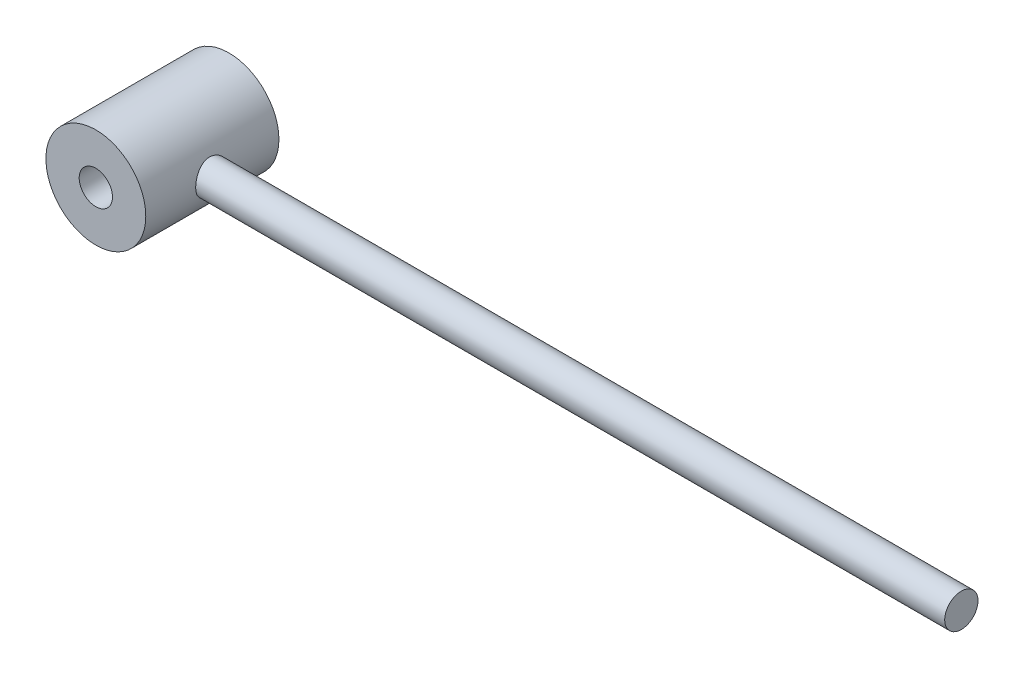
ISO-10303-21;
HEADER;
FILE_DESCRIPTION(('STEP AP214'),'2;1');
FILE_NAME('part.step','',(''),(''),'','','');
FILE_SCHEMA(('AUTOMOTIVE_DESIGN { 1 0 10303 214 1 1 1 1 }'));
ENDSEC;
DATA;
#1=APPLICATION_CONTEXT('core data for automotive mechanical design processes');
#2=APPLICATION_PROTOCOL_DEFINITION('international standard','automotive_design',2000,#1);
#3=PRODUCT_CONTEXT('',#1,'mechanical');
#4=PRODUCT('Part','Part','',(#3));
#5=PRODUCT_RELATED_PRODUCT_CATEGORY('part','',(#4));
#6=PRODUCT_DEFINITION_FORMATION('','',#4);
#7=PRODUCT_DEFINITION_CONTEXT('part definition',#1,'design');
#8=PRODUCT_DEFINITION('design','',#6,#7);
#9=PRODUCT_DEFINITION_SHAPE('','',#8);
#10=(LENGTH_UNIT() NAMED_UNIT(*) SI_UNIT(.MILLI.,.METRE.));
#11=(NAMED_UNIT(*) PLANE_ANGLE_UNIT() SI_UNIT($,.RADIAN.));
#12=(NAMED_UNIT(*) SI_UNIT($,.STERADIAN.) SOLID_ANGLE_UNIT());
#13=UNCERTAINTY_MEASURE_WITH_UNIT(LENGTH_MEASURE(1.E-05),#10,'distance_accuracy_value','');
#14=(GEOMETRIC_REPRESENTATION_CONTEXT(3) GLOBAL_UNCERTAINTY_ASSIGNED_CONTEXT((#13)) GLOBAL_UNIT_ASSIGNED_CONTEXT((#10,
#11,#12)) REPRESENTATION_CONTEXT('',''));
#15=CARTESIAN_POINT('',(0.,0.,0.));
#16=DIRECTION('',(0.,0.,1.));
#17=DIRECTION('',(1.,0.,0.));
#18=AXIS2_PLACEMENT_3D('',#15,#16,#17);
#19=CARTESIAN_POINT('',(0.,0.,-25.4));
#20=DIRECTION('',(0.,0.,1.));
#21=DIRECTION('',(1.,0.,0.));
#22=AXIS2_PLACEMENT_3D('',#19,#20,#21);
#23=CYLINDRICAL_SURFACE('',#22,19.05);
#24=CARTESIAN_POINT('',(0.,0.,-25.4));
#25=DIRECTION('',(0.,0.,1.));
#26=DIRECTION('',(1.,0.,0.));
#27=AXIS2_PLACEMENT_3D('',#24,#25,#26);
#28=CIRCLE('',#27,19.05);
#29=CARTESIAN_POINT('',(19.05,0.,-25.4));
#30=VERTEX_POINT('',#29);
#31=EDGE_CURVE('E45',#30,#30,#28,.T.);
#32=ORIENTED_EDGE('',*,*,#31,.T.);
#33=EDGE_LOOP('',(#32));
#34=FACE_BOUND('',#33,.T.);
#35=CARTESIAN_POINT('',(0.,0.,25.4));
#36=DIRECTION('',(0.,0.,1.));
#37=DIRECTION('',(1.,0.,0.));
#38=AXIS2_PLACEMENT_3D('',#35,#36,#37);
#39=CIRCLE('',#38,19.05);
#40=CARTESIAN_POINT('',(19.05,0.,25.4));
#41=VERTEX_POINT('',#40);
#42=EDGE_CURVE('E49',#41,#41,#39,.T.);
#43=ORIENTED_EDGE('',*,*,#42,.F.);
#44=EDGE_LOOP('',(#43));
#45=FACE_BOUND('',#44,.T.);
#46=CARTESIAN_POINT('',(19.0500000000001,0.,6.35));
#47=CARTESIAN_POINT('',(19.0500000475545,-0.173206979816119,6.35000007236222));
#48=CARTESIAN_POINT('',(19.0476323411038,-0.346412900541872,6.3429075600704));
#49=CARTESIAN_POINT('',(19.0382249618458,-0.691601311110428,6.31460114031544));
#50=CARTESIAN_POINT('',(19.0311835975216,-0.863583335207503,6.29338212009784));
#51=CARTESIAN_POINT('',(19.0126222999959,-1.20495064928588,6.23702757623515));
#52=CARTESIAN_POINT('',(19.0011036986832,-1.37433669595719,6.20189619118303));
#53=CARTESIAN_POINT('',(18.9738932742665,-1.70942803420246,6.11802244062094));
#54=CARTESIAN_POINT('',(18.9581998392036,-1.87513187719383,6.06927481733638));
#55=CARTESIAN_POINT('',(18.9230954347253,-2.20132105058003,5.95871469261192));
#56=CARTESIAN_POINT('',(18.9036923038523,-2.36181656426822,5.89692971091266));
#57=CARTESIAN_POINT('',(18.861643657703,-2.67697294486434,5.76071157228421));
#58=CARTESIAN_POINT('',(18.8389969432077,-2.83163162693659,5.68627373542708));
#59=CARTESIAN_POINT('',(18.7910497757426,-3.1340689975051,5.52534595404424));
#60=CARTESIAN_POINT('',(18.7657498753001,-3.28184910924856,5.43885851762675));
#61=CARTESIAN_POINT('',(18.7131195970424,-3.56974509074052,5.25439435152895));
#62=CARTESIAN_POINT('',(18.6857884919782,-3.7098581839242,5.15641349943325));
#63=CARTESIAN_POINT('',(18.6289146881802,-3.98578637726498,4.94641198872552));
#64=CARTESIAN_POINT('',(18.5993296703084,-4.12133296305892,4.83404987098847));
#65=CARTESIAN_POINT('',(18.5395154443744,-4.38255929576645,4.59854343363201));
#66=CARTESIAN_POINT('',(18.5092862220122,-4.50823882336201,4.47539887447669));
#67=CARTESIAN_POINT('',(18.4489772883087,-4.74901553774604,4.21903852526588));
#68=CARTESIAN_POINT('',(18.4188976388164,-4.86410864366073,4.08581888720946));
#69=CARTESIAN_POINT('',(18.3597250300466,-5.08289666356065,3.810198173399));
#70=CARTESIAN_POINT('',(18.3306317360784,-5.18659547118077,3.66780026058159));
#71=CARTESIAN_POINT('',(18.2734042587362,-5.38480736636175,3.37034355668632));
#72=CARTESIAN_POINT('',(18.2453229440573,-5.47896348886475,3.21503638975728));
#73=CARTESIAN_POINT('',(18.1919156575976,-5.65376497667273,2.89662107107056));
#74=CARTESIAN_POINT('',(18.1665886001519,-5.73441567232333,2.73351602982091));
#75=CARTESIAN_POINT('',(18.1194737199416,-5.88159402568305,2.40051929302497));
#76=CARTESIAN_POINT('',(18.0976865250677,-5.94811917848412,2.23062640011281));
#77=CARTESIAN_POINT('',(18.0583841320978,-6.0663951536629,1.88537230890351));
#78=CARTESIAN_POINT('',(18.0408669880933,-6.11815270763608,1.71001364266552));
#79=CARTESIAN_POINT('',(18.0111940183235,-6.20495158956038,1.36100206959846));
#80=CARTESIAN_POINT('',(17.9988790739554,-6.24049221012224,1.18748684129989));
#81=CARTESIAN_POINT('',(17.9791995169245,-6.29696610143421,0.837886974474447));
#82=CARTESIAN_POINT('',(17.9718328403146,-6.31790546258155,0.661803438553155));
#83=CARTESIAN_POINT('',(17.9622908169983,-6.34498350403309,0.308373359394689));
#84=CARTESIAN_POINT('',(17.960115112419,-6.35112320464729,0.131026904070518));
#85=CARTESIAN_POINT('',(17.9610285072459,-6.3485398247218,-0.223541446717684));
#86=CARTESIAN_POINT('',(17.9641174580944,-6.33981716356741,-0.400763345555272));
#87=CARTESIAN_POINT('',(17.9751928357032,-6.30834384063319,-0.745573907167516));
#88=CARTESIAN_POINT('',(17.9829477165395,-6.2862561392762,-0.913231049784087));
#89=CARTESIAN_POINT('',(18.0029174212393,-6.22883516245982,-1.24604885612463));
#90=CARTESIAN_POINT('',(18.0151337459671,-6.19349742948017,-1.41120866023015));
#91=CARTESIAN_POINT('',(18.0436560154073,-6.10990376478512,-1.73781008442545));
#92=CARTESIAN_POINT('',(18.0599608142595,-6.06165145233205,-1.89925273248902));
#93=CARTESIAN_POINT('',(18.0961946727035,-5.95260759283797,-2.21749107795386));
#94=CARTESIAN_POINT('',(18.1161251081381,-5.8918112844695,-2.37428498490984));
#95=CARTESIAN_POINT('',(18.1593846683067,-5.75711105118028,-2.6846294633379));
#96=CARTESIAN_POINT('',(18.182762287283,-5.68301613062838,-2.83809032643096));
#97=CARTESIAN_POINT('',(18.2320325481052,-5.52290717349518,-3.13830347808929));
#98=CARTESIAN_POINT('',(18.2579260483393,-5.43688906456495,-3.28505345168724));
#99=CARTESIAN_POINT('',(18.3115276913353,-5.25352969212448,-3.57096192219749));
#100=CARTESIAN_POINT('',(18.3392359583063,-5.15618765320852,-3.71011989828848));
#101=CARTESIAN_POINT('',(18.3957458615903,-4.95079561055338,-3.9800614588839));
#102=CARTESIAN_POINT('',(18.4245475365431,-4.84274522817477,-4.11084474699597));
#103=CARTESIAN_POINT('',(18.4840358963059,-4.61064072542746,-4.36993191361443));
#104=CARTESIAN_POINT('',(18.5147422324821,-4.48604452199054,-4.49774619120738));
#105=CARTESIAN_POINT('',(18.575703434143,-4.22652342644297,-4.74244643375364));
#106=CARTESIAN_POINT('',(18.6059584388461,-4.09160180148376,-4.85933582974747));
#107=CARTESIAN_POINT('',(18.6652179866419,-3.81215729550635,-5.08151886906242));
#108=CARTESIAN_POINT('',(18.6942219279428,-3.66762987695636,-5.18680696891136));
#109=CARTESIAN_POINT('',(18.7501624717454,-3.36998882083472,-5.38494421384189));
#110=CARTESIAN_POINT('',(18.777099890208,-3.21687861391425,-5.47779827937779));
#111=CARTESIAN_POINT('',(18.8284460358764,-2.90136608662604,-5.651311532146));
#112=CARTESIAN_POINT('',(18.852825607187,-2.73888379955611,-5.73183410585706));
#113=CARTESIAN_POINT('',(18.8980298666498,-2.40727117302262,-5.8788113974916));
#114=CARTESIAN_POINT('',(18.9188559320642,-2.23814344060154,-5.9452715681074));
#115=CARTESIAN_POINT('',(18.9563603220822,-1.89440949234185,-6.06355877710102));
#116=CARTESIAN_POINT('',(18.9730389841577,-1.71980372355068,-6.11538700611774));
#117=CARTESIAN_POINT('',(19.0017577647123,-1.36642567213485,-6.20391443988912));
#118=CARTESIAN_POINT('',(19.0137980966785,-1.18765358167399,-6.24061434095634));
#119=CARTESIAN_POINT('',(19.0324663756725,-0.835171292256398,-6.2972579625842));
#120=CARTESIAN_POINT('',(19.0393063851572,-0.661577761094119,-6.31785928904507));
#121=CARTESIAN_POINT('',(19.0482228098157,-0.313163139048647,-6.34467916806364));
#122=CARTESIAN_POINT('',(19.0502993738781,-0.138342086704823,-6.35089817016279));
#123=CARTESIAN_POINT('',(19.0496310005562,0.211180699577593,-6.34889295161773));
#124=CARTESIAN_POINT('',(19.0468867839424,0.385882447447027,-6.34067089010429));
#125=CARTESIAN_POINT('',(19.0366548939182,0.733873450364131,-6.30986849481265));
#126=CARTESIAN_POINT('',(19.0291672684097,0.907162719658029,-6.28728830603216));
#127=CARTESIAN_POINT('',(19.0099421572362,1.24601609779627,-6.22885514002343));
#128=CARTESIAN_POINT('',(18.9983351567187,1.41165802541743,-6.19340899649916));
#129=CARTESIAN_POINT('',(18.9711429855808,1.73933064567692,-6.10948783302439));
#130=CARTESIAN_POINT('',(18.9555564909225,1.90136011684895,-6.06100847644152));
#131=CARTESIAN_POINT('',(18.9208084901865,2.220651022374,-5.95144440257775));
#132=CARTESIAN_POINT('',(18.901647943518,2.37791372316701,-5.89036306767316));
#133=CARTESIAN_POINT('',(18.8602202631813,2.68679846475974,-5.75603940084982));
#134=CARTESIAN_POINT('',(18.8379519552898,2.8384183459438,-5.68279247033567));
#135=CARTESIAN_POINT('',(18.7902499584476,3.13890847872104,-5.52263402879024));
#136=CARTESIAN_POINT('',(18.7647491525867,3.28760543041953,-5.43541738983305));
#137=CARTESIAN_POINT('',(18.7116999684213,3.57721512709605,-5.24934927668615));
#138=CARTESIAN_POINT('',(18.6841508852828,3.71812516316431,-5.15049379055311));
#139=CARTESIAN_POINT('',(18.6277060092511,3.9913064038726,-4.94181342405383));
#140=CARTESIAN_POINT('',(18.5988100867056,4.12357677386764,-4.83198748645893));
#141=CARTESIAN_POINT('',(18.54040247239,4.37871059436874,-4.60205244922268));
#142=CARTESIAN_POINT('',(18.5108907645187,4.50157379850995,-4.48194308044228));
#143=CARTESIAN_POINT('',(18.4506550930792,4.74256806278789,-4.2264380874391));
#144=CARTESIAN_POINT('',(18.4199373319635,4.8602266133604,-4.09059482255704));
#145=CARTESIAN_POINT('',(18.3595255094858,5.08367167126114,-3.80933472828));
#146=CARTESIAN_POINT('',(18.3298311117932,5.18946210535387,-3.66392109081897));
#147=CARTESIAN_POINT('',(18.2723024560637,5.38852533514399,-3.36432063190289));
#148=CARTESIAN_POINT('',(18.2444689823258,5.4817928694692,-3.2101301614477));
#149=CARTESIAN_POINT('',(18.1915213339223,5.65502039443442,-2.89408070743543));
#150=CARTESIAN_POINT('',(18.1664060282044,5.73498592764396,-2.73222495408416));
#151=CARTESIAN_POINT('',(18.119700256613,5.88088643247244,-2.40212109963055));
#152=CARTESIAN_POINT('',(18.0981043206734,5.94684322686594,-2.23388342941608));
#153=CARTESIAN_POINT('',(18.0590959794666,6.06427106193969,-1.8920265973133));
#154=CARTESIAN_POINT('',(18.0416818566593,6.11574805121027,-1.71840967796516));
#155=CARTESIAN_POINT('',(18.0116128053345,6.20374641951342,-1.36704911888999));
#156=CARTESIAN_POINT('',(17.9989570671825,6.24027034288944,-1.18930618666934));
#157=CARTESIAN_POINT('',(17.9788400300668,6.29799572673677,-0.831061098680284));
#158=CARTESIAN_POINT('',(17.9713784693274,6.31919795939107,-0.650559082432526));
#159=CARTESIAN_POINT('',(17.9621566611392,6.34536101450615,-0.297614645785039));
#160=CARTESIAN_POINT('',(17.9601221272408,6.35110334330266,-0.125236873840139));
#161=CARTESIAN_POINT('',(17.9610259404646,6.3485471048946,0.219462643630245));
#162=CARTESIAN_POINT('',(17.9639659778814,6.34024376515534,0.391784350204961));
#163=CARTESIAN_POINT('',(17.9747253646517,6.30967578351914,0.734952272210978));
#164=CARTESIAN_POINT('',(17.9825425843042,6.28741723537024,0.905799098677062));
#165=CARTESIAN_POINT('',(18.0028096475755,6.22914877747747,1.24491595692694));
#166=CARTESIAN_POINT('',(18.0152612311773,6.19313370267922,1.41318499613742));
#167=CARTESIAN_POINT('',(18.0441256220386,6.10851743523393,1.74266517616778));
#168=CARTESIAN_POINT('',(18.0604567799901,6.0601743306519,1.903949924091));
#169=CARTESIAN_POINT('',(18.0967328909403,5.95097195531922,2.22186695274437));
#170=CARTESIAN_POINT('',(18.1166791257158,5.89010824417334,2.37849756028204));
#171=CARTESIAN_POINT('',(18.1596190192289,5.75635872960047,2.68606629359752));
#172=CARTESIAN_POINT('',(18.1826121279965,5.68347509522737,2.83700544040035));
#173=CARTESIAN_POINT('',(18.2310369188305,5.52617088916445,3.13240298168561));
#174=CARTESIAN_POINT('',(18.2564694762833,5.44174617134764,3.27685902222999));
#175=CARTESIAN_POINT('',(18.3102500594208,5.25802199045283,3.56455997690772));
#176=CARTESIAN_POINT('',(18.3386767604253,5.15823547260394,3.70747930623795));
#177=CARTESIAN_POINT('',(18.3966802768163,4.94738392202038,3.98449421498275));
#178=CARTESIAN_POINT('',(18.4262571319251,4.83631849953624,4.11858948921263));
#179=CARTESIAN_POINT('',(18.4857849167109,4.60355182793463,4.37722408014619));
#180=CARTESIAN_POINT('',(18.51573599931,4.4818461003171,4.50175933121995));
#181=CARTESIAN_POINT('',(18.5752059114817,4.22860900687016,4.74042503332823));
#182=CARTESIAN_POINT('',(18.6047248792629,4.09708086858837,4.85455887503141));
#183=CARTESIAN_POINT('',(18.6637175514635,3.81956162783047,5.07604123286005));
#184=CARTESIAN_POINT('',(18.6931435726951,3.67320473285501,5.18294472641157));
#185=CARTESIAN_POINT('',(18.7498785198637,3.37165840160099,5.38398024832417));
#186=CARTESIAN_POINT('',(18.7771882370501,3.21647230441004,5.47811705989696));
#187=CARTESIAN_POINT('',(18.8289382459717,2.89820274632955,5.65295427340201));
#188=CARTESIAN_POINT('',(18.8533779536693,2.73511768753171,5.73365194190559));
#189=CARTESIAN_POINT('',(18.8986713660276,2.40227193910478,5.88087464482119));
#190=CARTESIAN_POINT('',(18.9195266767198,2.23251428132622,5.94740602981343));
#191=CARTESIAN_POINT('',(18.9562248471232,1.89513703853369,6.0631126819212));
#192=CARTESIAN_POINT('',(18.9722488458237,1.72775594881918,6.11292631492055));
#193=CARTESIAN_POINT('',(19.0000391476739,1.38918879693755,6.1986396073812));
#194=CARTESIAN_POINT('',(19.0118071856555,1.21800431539599,6.23454493662667));
#195=CARTESIAN_POINT('',(19.0307694822748,0.873014688703105,6.29213217765746));
#196=CARTESIAN_POINT('',(19.0379639392381,0.699209657522143,6.31381470619194));
#197=CARTESIAN_POINT('',(19.0475791674846,0.350269387520863,6.34274856090481));
#198=CARTESIAN_POINT('',(19.0499999519165,0.175134152365814,6.34999992683265));
#199=CARTESIAN_POINT('',(19.0500000000001,0.,6.35));
#200=B_SPLINE_CURVE_WITH_KNOTS('',3,(#46,#47,#48,#49,#50,#51,#52,#53,#54,#55,#56,#57,#58,#59,
#60,#61,#62,#63,#64,#65,#66,#67,#68,#69,#70,#71,#72,#73,#74,#75,#76,#77,#78,#79,#80,#81,#82,#83,
#84,#85,#86,#87,#88,#89,#90,#91,#92,#93,#94,#95,#96,#97,#98,#99,#100,#101,#102,#103,#104,#105,
#106,#107,#108,#109,#110,#111,#112,#113,#114,#115,#116,#117,#118,#119,#120,#121,#122,#123,#124,
#125,#126,#127,#128,#129,#130,#131,#132,#133,#134,#135,#136,#137,#138,#139,#140,#141,#142,#143,
#144,#145,#146,#147,#148,#149,#150,#151,#152,#153,#154,#155,#156,#157,#158,#159,#160,#161,#162,
#163,#164,#165,#166,#167,#168,#169,#170,#171,#172,#173,#174,#175,#176,#177,#178,#179,#180,#181,
#182,#183,#184,#185,#186,#187,#188,#189,#190,#191,#192,#193,#194,#195,#196,#197,#198,#199),
.UNSPECIFIED.,.T.,.F.,(4,2,2,2,2,2,2,2,2,2,2,2,2,2,2,2,2,2,2,2,2,2,2,2,2,2,2,2,2,2,2,2,2,2,2,2,
2,2,2,2,2,2,2,2,2,2,2,2,2,2,2,2,2,2,2,2,2,2,2,2,2,2,2,2,2,2,2,2,2,2,2,2,2,2,2,2,4),(0.,
0.519458569393281,1.03910524677537,1.55859745778492,2.07829054350247,2.59689742324835,
3.11569653985646,3.63438783000184,4.15326573456096,4.68825393169904,5.22325401681388,
5.75845947796999,6.29348147733767,6.84413750048857,7.39457567487729,7.94511137809322,
8.49539572520654,9.02735412227896,9.55909049884019,10.0907902156778,10.6224749292908,
11.1297302811144,11.637156434996,12.1444405332349,12.6519175368141,13.1673706187555,
13.6830001888055,14.1986650873782,14.7143482260051,15.2570716454941,15.7996240418451,
16.3424345730851,16.885029661983,17.4332578936979,17.981273158951,18.529243817924,
19.0771892525985,19.6013734715542,20.1255413061125,20.64963077729,21.1737149559553,
21.6824953195602,22.1914451831988,22.7002586217751,23.2092648314003,23.7314723590617,
24.253860423066,24.7762988785646,25.2987510115601,25.8450678149493,26.3912033238478,
26.9375675729377,27.4837035940661,28.0289825026793,28.5740370716691,29.1189988581493,
29.6639331777145,30.1807526946974,30.6977478554779,31.2145174197616,31.7314812024582,
32.2384024781404,32.7455038428125,33.2525137984933,33.7597063782055,34.2889454073645,
34.8182027309295,35.3476839011333,35.876991848137,36.4271714288383,36.9771443043958,
37.5272289043732,38.0770663862097,38.6025433311706,39.1278058370275,39.6530455642045,
40.1782838446504),.UNSPECIFIED.);
#201=CARTESIAN_POINT('',(19.0500000000001,0.,6.35));
#202=VERTEX_POINT('',#201);
#203=EDGE_CURVE('E35',#202,#202,#200,.T.);
#204=ORIENTED_EDGE('',*,*,#203,.F.);
#205=EDGE_LOOP('',(#204));
#206=FACE_BOUND('',#205,.T.);
#207=ADVANCED_FACE('F30',(#34,#45,#206),#23,.T.);
#208=CARTESIAN_POINT('',(0.,0.,-25.4));
#209=DIRECTION('',(0.,0.,1.));
#210=DIRECTION('',(1.,0.,0.));
#211=AXIS2_PLACEMENT_3D('',#208,#209,#210);
#212=PLANE('',#211);
#213=CARTESIAN_POINT('',(0.,0.,-25.4));
#214=DIRECTION('',(0.,0.,1.));
#215=DIRECTION('',(1.,0.,0.));
#216=AXIS2_PLACEMENT_3D('',#213,#214,#215);
#217=CIRCLE('',#216,6.35);
#218=CARTESIAN_POINT('',(6.35,0.,-25.4));
#219=VERTEX_POINT('',#218);
#220=EDGE_CURVE('E52',#219,#219,#217,.F.);
#221=ORIENTED_EDGE('',*,*,#220,.F.);
#222=EDGE_LOOP('',(#221));
#223=FACE_BOUND('',#222,.T.);
#224=ORIENTED_EDGE('',*,*,#31,.F.);
#225=EDGE_LOOP('',(#224));
#226=FACE_BOUND('',#225,.T.);
#227=ADVANCED_FACE('F65',(#223,#226),#212,.F.);
#228=CARTESIAN_POINT('',(0.,0.,25.4));
#229=DIRECTION('',(0.,0.,1.));
#230=DIRECTION('',(1.,0.,0.));
#231=AXIS2_PLACEMENT_3D('',#228,#229,#230);
#232=PLANE('',#231);
#233=CARTESIAN_POINT('',(0.,0.,25.4));
#234=DIRECTION('',(0.,0.,1.));
#235=DIRECTION('',(1.,0.,0.));
#236=AXIS2_PLACEMENT_3D('',#233,#234,#235);
#237=CIRCLE('',#236,6.35);
#238=CARTESIAN_POINT('',(6.35,0.,25.4));
#239=VERTEX_POINT('',#238);
#240=EDGE_CURVE('E55',#239,#239,#237,.T.);
#241=ORIENTED_EDGE('',*,*,#240,.F.);
#242=EDGE_LOOP('',(#241));
#243=FACE_BOUND('',#242,.T.);
#244=ORIENTED_EDGE('',*,*,#42,.T.);
#245=EDGE_LOOP('',(#244));
#246=FACE_BOUND('',#245,.T.);
#247=ADVANCED_FACE('F62',(#243,#246),#232,.T.);
#248=CARTESIAN_POINT('',(304.8,0.,0.));
#249=DIRECTION('',(-1.,0.,0.));
#250=DIRECTION('',(0.,0.,1.));
#251=AXIS2_PLACEMENT_3D('',#248,#249,#250);
#252=CYLINDRICAL_SURFACE('',#251,6.35);
#253=ORIENTED_EDGE('',*,*,#203,.T.);
#254=EDGE_LOOP('',(#253));
#255=FACE_BOUND('',#254,.T.);
#256=CARTESIAN_POINT('',(304.8,0.,0.));
#257=DIRECTION('',(1.,0.,0.));
#258=DIRECTION('',(0.,0.,-1.));
#259=AXIS2_PLACEMENT_3D('',#256,#257,#258);
#260=CIRCLE('',#259,6.35);
#261=CARTESIAN_POINT('',(304.8,0.,-6.35));
#262=VERTEX_POINT('',#261);
#263=EDGE_CURVE('E10',#262,#262,#260,.T.);
#264=ORIENTED_EDGE('',*,*,#263,.F.);
#265=EDGE_LOOP('',(#264));
#266=FACE_BOUND('',#265,.T.);
#267=ADVANCED_FACE('F32',(#255,#266),#252,.T.);
#268=CARTESIAN_POINT('',(304.8,0.,0.));
#269=DIRECTION('',(1.,0.,0.));
#270=DIRECTION('',(0.,0.,-1.));
#271=AXIS2_PLACEMENT_3D('',#268,#269,#270);
#272=PLANE('',#271);
#273=ORIENTED_EDGE('',*,*,#263,.T.);
#274=EDGE_LOOP('',(#273));
#275=FACE_BOUND('',#274,.T.);
#276=ADVANCED_FACE('F76',(#275),#272,.T.);
#277=CARTESIAN_POINT('',(0.,0.,-25.401));
#278=DIRECTION('',(0.,0.,1.));
#279=DIRECTION('',(1.,0.,0.));
#280=AXIS2_PLACEMENT_3D('',#277,#278,#279);
#281=CYLINDRICAL_SURFACE('',#280,6.35);
#282=ORIENTED_EDGE('',*,*,#240,.T.);
#283=EDGE_LOOP('',(#282));
#284=FACE_BOUND('',#283,.T.);
#285=ORIENTED_EDGE('',*,*,#220,.T.);
#286=EDGE_LOOP('',(#285));
#287=FACE_BOUND('',#286,.T.);
#288=ADVANCED_FACE('F59',(#284,#287),#281,.F.);
#289=CLOSED_SHELL('',(#207,#227,#247,#267,#276,#288));
#290=MANIFOLD_SOLID_BREP('B2',#289);
#291=ADVANCED_BREP_SHAPE_REPRESENTATION('',(#18,#290),#14);
#292=SHAPE_DEFINITION_REPRESENTATION(#9,#291);
ENDSEC;
END-ISO-10303-21;
